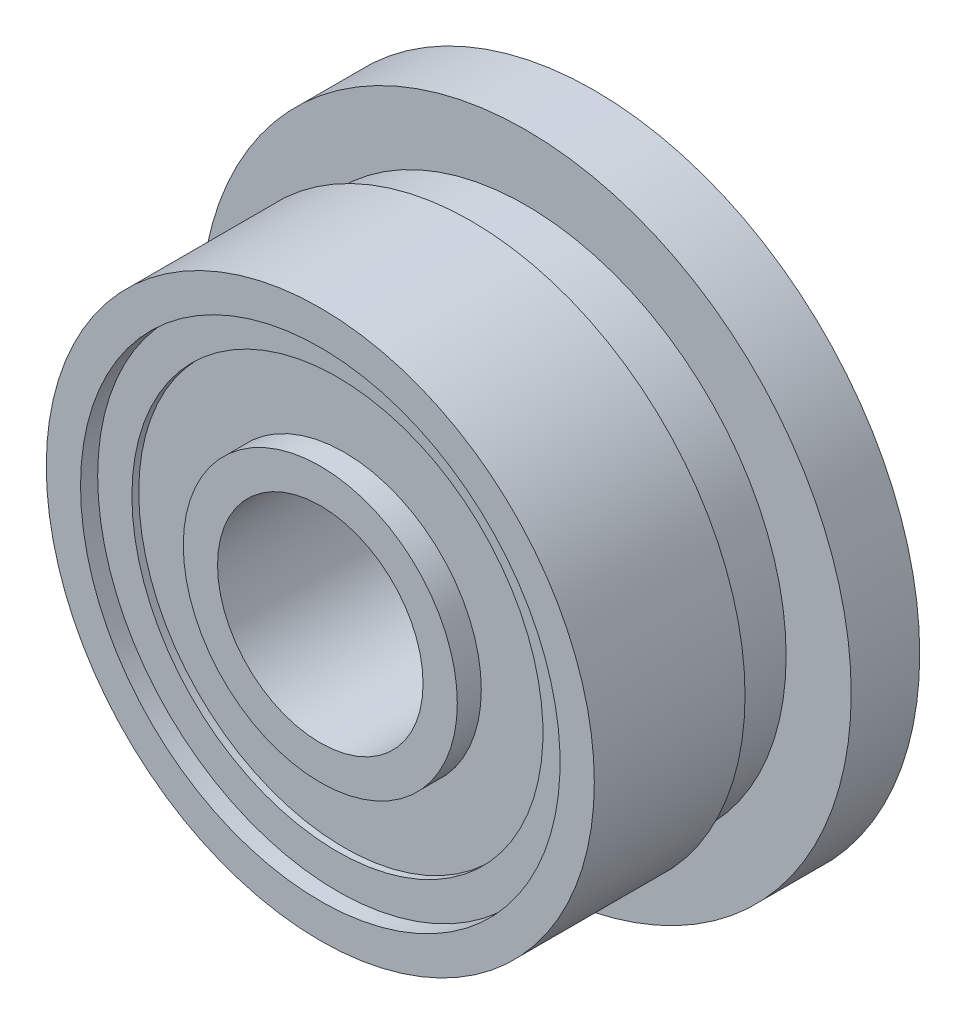
ISO-10303-21;
HEADER;
FILE_DESCRIPTION(('STEP AP214'),'2;1');
FILE_NAME('part.step','',(''),(''),'','','');
FILE_SCHEMA(('AUTOMOTIVE_DESIGN { 1 0 10303 214 1 1 1 1 }'));
ENDSEC;
DATA;
#1=APPLICATION_CONTEXT('core data for automotive mechanical design processes');
#2=APPLICATION_PROTOCOL_DEFINITION('international standard','automotive_design',2000,#1);
#3=PRODUCT_CONTEXT('',#1,'mechanical');
#4=PRODUCT('Part','Part','',(#3));
#5=PRODUCT_RELATED_PRODUCT_CATEGORY('part','',(#4));
#6=PRODUCT_DEFINITION_FORMATION('','',#4);
#7=PRODUCT_DEFINITION_CONTEXT('part definition',#1,'design');
#8=PRODUCT_DEFINITION('design','',#6,#7);
#9=PRODUCT_DEFINITION_SHAPE('','',#8);
#10=(LENGTH_UNIT() NAMED_UNIT(*) SI_UNIT(.MILLI.,.METRE.));
#11=(NAMED_UNIT(*) PLANE_ANGLE_UNIT() SI_UNIT($,.RADIAN.));
#12=(NAMED_UNIT(*) SI_UNIT($,.STERADIAN.) SOLID_ANGLE_UNIT());
#13=UNCERTAINTY_MEASURE_WITH_UNIT(LENGTH_MEASURE(1.E-05),#10,'distance_accuracy_value','');
#14=(GEOMETRIC_REPRESENTATION_CONTEXT(3) GLOBAL_UNCERTAINTY_ASSIGNED_CONTEXT((#13)) GLOBAL_UNIT_ASSIGNED_CONTEXT((#10,
#11,#12)) REPRESENTATION_CONTEXT('',''));
#15=CARTESIAN_POINT('',(0.,0.,0.));
#16=DIRECTION('',(0.,0.,1.));
#17=DIRECTION('',(1.,0.,0.));
#18=AXIS2_PLACEMENT_3D('',#15,#16,#17);
#19=CARTESIAN_POINT('',(0.,0.,3.75));
#20=DIRECTION('',(0.,0.,1.));
#21=DIRECTION('',(-1.,0.,0.));
#22=AXIS2_PLACEMENT_3D('',#19,#20,#21);
#23=PLANE('',#22);
#24=CARTESIAN_POINT('',(0.,0.,3.75));
#25=DIRECTION('',(0.,0.,-1.));
#26=DIRECTION('',(-1.,0.,0.));
#27=AXIS2_PLACEMENT_3D('',#24,#25,#26);
#28=CIRCLE('',#27,3.5);
#29=CARTESIAN_POINT('',(-3.5,0.,3.75));
#30=VERTEX_POINT('',#29);
#31=EDGE_CURVE('E85',#30,#30,#28,.T.);
#32=ORIENTED_EDGE('',*,*,#31,.F.);
#33=EDGE_LOOP('',(#32));
#34=FACE_BOUND('',#33,.T.);
#35=CARTESIAN_POINT('',(0.,0.,3.75));
#36=DIRECTION('',(0.,0.,-1.));
#37=DIRECTION('',(-1.,0.,0.));
#38=AXIS2_PLACEMENT_3D('',#35,#36,#37);
#39=CIRCLE('',#38,3.);
#40=CARTESIAN_POINT('',(-3.,0.,3.75));
#41=VERTEX_POINT('',#40);
#42=EDGE_CURVE('E98',#41,#41,#39,.T.);
#43=ORIENTED_EDGE('',*,*,#42,.T.);
#44=EDGE_LOOP('',(#43));
#45=FACE_BOUND('',#44,.T.);
#46=ADVANCED_FACE('F41',(#34,#45),#23,.T.);
#47=CARTESIAN_POINT('',(0.,0.,4.));
#48=DIRECTION('',(0.,0.,1.));
#49=DIRECTION('',(1.,0.,0.));
#50=AXIS2_PLACEMENT_3D('',#47,#48,#49);
#51=PLANE('',#50);
#52=CARTESIAN_POINT('',(0.,0.,4.));
#53=DIRECTION('',(0.,0.,1.));
#54=DIRECTION('',(1.,0.,0.));
#55=AXIS2_PLACEMENT_3D('',#52,#53,#54);
#56=CIRCLE('',#55,1.5);
#57=CARTESIAN_POINT('',(1.5,0.,4.));
#58=VERTEX_POINT('',#57);
#59=EDGE_CURVE('E54',#58,#58,#56,.T.);
#60=ORIENTED_EDGE('',*,*,#59,.F.);
#61=EDGE_LOOP('',(#60));
#62=FACE_BOUND('',#61,.T.);
#63=CARTESIAN_POINT('',(0.,0.,4.));
#64=DIRECTION('',(0.,0.,-1.));
#65=DIRECTION('',(-1.,0.,0.));
#66=AXIS2_PLACEMENT_3D('',#63,#64,#65);
#67=CIRCLE('',#66,2.);
#68=CARTESIAN_POINT('',(-2.,0.,4.));
#69=VERTEX_POINT('',#68);
#70=EDGE_CURVE('E90',#69,#69,#67,.T.);
#71=ORIENTED_EDGE('',*,*,#70,.F.);
#72=EDGE_LOOP('',(#71));
#73=FACE_BOUND('',#72,.T.);
#74=ADVANCED_FACE('F150',(#62,#73),#51,.T.);
#75=CARTESIAN_POINT('',(0.,0.,0.));
#76=DIRECTION('',(0.,0.,1.));
#77=DIRECTION('',(1.,0.,0.));
#78=AXIS2_PLACEMENT_3D('',#75,#76,#77);
#79=PLANE('',#78);
#80=CARTESIAN_POINT('',(0.,0.,0.));
#81=DIRECTION('',(0.,0.,1.));
#82=DIRECTION('',(1.,0.,0.));
#83=AXIS2_PLACEMENT_3D('',#80,#81,#82);
#84=CIRCLE('',#83,1.5);
#85=CARTESIAN_POINT('',(1.5,0.,0.));
#86=VERTEX_POINT('',#85);
#87=EDGE_CURVE('E49',#86,#86,#84,.T.);
#88=ORIENTED_EDGE('',*,*,#87,.T.);
#89=EDGE_LOOP('',(#88));
#90=FACE_BOUND('',#89,.T.);
#91=CARTESIAN_POINT('',(0.,0.,0.));
#92=DIRECTION('',(0.,0.,-1.));
#93=DIRECTION('',(-1.,0.,0.));
#94=AXIS2_PLACEMENT_3D('',#91,#92,#93);
#95=CIRCLE('',#94,2.);
#96=CARTESIAN_POINT('',(-2.,0.,0.));
#97=VERTEX_POINT('',#96);
#98=EDGE_CURVE('E66',#97,#97,#95,.T.);
#99=ORIENTED_EDGE('',*,*,#98,.T.);
#100=EDGE_LOOP('',(#99));
#101=FACE_BOUND('',#100,.T.);
#102=ADVANCED_FACE('F156',(#90,#101),#79,.F.);
#103=CARTESIAN_POINT('',(0.,0.,4.));
#104=DIRECTION('',(0.,0.,-1.));
#105=DIRECTION('',(-1.,0.,0.));
#106=AXIS2_PLACEMENT_3D('',#103,#104,#105);
#107=CYLINDRICAL_SURFACE('',#106,4.);
#108=CARTESIAN_POINT('',(0.,0.,1.8));
#109=DIRECTION('',(0.,0.,1.));
#110=DIRECTION('',(1.,0.,0.));
#111=AXIS2_PLACEMENT_3D('',#108,#109,#110);
#112=CIRCLE('',#111,4.);
#113=CARTESIAN_POINT('',(4.,0.,1.8));
#114=VERTEX_POINT('',#113);
#115=EDGE_CURVE('E114',#114,#114,#112,.T.);
#116=ORIENTED_EDGE('',*,*,#115,.T.);
#117=EDGE_LOOP('',(#116));
#118=FACE_BOUND('',#117,.T.);
#119=CARTESIAN_POINT('',(0.,0.,4.));
#120=DIRECTION('',(0.,0.,1.));
#121=DIRECTION('',(1.,0.,0.));
#122=AXIS2_PLACEMENT_3D('',#119,#120,#121);
#123=CIRCLE('',#122,4.);
#124=CARTESIAN_POINT('',(4.,0.,4.));
#125=VERTEX_POINT('',#124);
#126=EDGE_CURVE('E10',#125,#125,#123,.T.);
#127=ORIENTED_EDGE('',*,*,#126,.F.);
#128=EDGE_LOOP('',(#127));
#129=FACE_BOUND('',#128,.T.);
#130=ADVANCED_FACE('F43',(#118,#129),#107,.T.);
#131=CARTESIAN_POINT('',(0.,0.,4.));
#132=DIRECTION('',(0.,0.,-1.));
#133=DIRECTION('',(-1.,0.,0.));
#134=AXIS2_PLACEMENT_3D('',#131,#132,#133);
#135=CIRCLE('',#134,3.5);
#136=CARTESIAN_POINT('',(-3.5,0.,4.));
#137=VERTEX_POINT('',#136);
#138=EDGE_CURVE('E86',#137,#137,#135,.T.);
#139=ORIENTED_EDGE('',*,*,#138,.T.);
#140=EDGE_LOOP('',(#139));
#141=FACE_BOUND('',#140,.T.);
#142=ORIENTED_EDGE('',*,*,#126,.T.);
#143=EDGE_LOOP('',(#142));
#144=FACE_BOUND('',#143,.T.);
#145=ADVANCED_FACE('F159',(#141,#144),#51,.T.);
#146=CARTESIAN_POINT('',(0.,0.,0.));
#147=DIRECTION('',(0.,0.,-1.));
#148=DIRECTION('',(-1.,0.,0.));
#149=AXIS2_PLACEMENT_3D('',#146,#147,#148);
#150=CIRCLE('',#149,3.5);
#151=CARTESIAN_POINT('',(-3.5,0.,0.));
#152=VERTEX_POINT('',#151);
#153=EDGE_CURVE('E62',#152,#152,#150,.T.);
#154=ORIENTED_EDGE('',*,*,#153,.F.);
#155=EDGE_LOOP('',(#154));
#156=FACE_BOUND('',#155,.T.);
#157=CARTESIAN_POINT('',(0.,0.,0.));
#158=DIRECTION('',(0.,0.,1.));
#159=DIRECTION('',(1.,0.,0.));
#160=AXIS2_PLACEMENT_3D('',#157,#158,#159);
#161=CIRCLE('',#160,4.75);
#162=CARTESIAN_POINT('',(4.75,0.,0.));
#163=VERTEX_POINT('',#162);
#164=EDGE_CURVE('E110',#163,#163,#161,.T.);
#165=ORIENTED_EDGE('',*,*,#164,.F.);
#166=EDGE_LOOP('',(#165));
#167=FACE_BOUND('',#166,.T.);
#168=ADVANCED_FACE('F191',(#156,#167),#79,.F.);
#169=CARTESIAN_POINT('',(0.,0.,0.));
#170=DIRECTION('',(0.,0.,1.));
#171=DIRECTION('',(1.,0.,0.));
#172=AXIS2_PLACEMENT_3D('',#169,#170,#171);
#173=CYLINDRICAL_SURFACE('',#172,1.5);
#174=ORIENTED_EDGE('',*,*,#87,.F.);
#175=EDGE_LOOP('',(#174));
#176=FACE_BOUND('',#175,.T.);
#177=ORIENTED_EDGE('',*,*,#59,.T.);
#178=EDGE_LOOP('',(#177));
#179=FACE_BOUND('',#178,.T.);
#180=ADVANCED_FACE('F188',(#176,#179),#173,.F.);
#181=CARTESIAN_POINT('',(0.,0.,0.25));
#182=DIRECTION('',(0.,0.,-1.));
#183=DIRECTION('',(-1.,0.,0.));
#184=AXIS2_PLACEMENT_3D('',#181,#182,#183);
#185=CYLINDRICAL_SURFACE('',#184,3.5);
#186=CARTESIAN_POINT('',(0.,0.,0.25));
#187=DIRECTION('',(0.,0.,-1.));
#188=DIRECTION('',(-1.,0.,0.));
#189=AXIS2_PLACEMENT_3D('',#186,#187,#188);
#190=CIRCLE('',#189,3.5);
#191=CARTESIAN_POINT('',(-3.5,0.,0.25));
#192=VERTEX_POINT('',#191);
#193=EDGE_CURVE('E60',#192,#192,#190,.T.);
#194=ORIENTED_EDGE('',*,*,#193,.F.);
#195=EDGE_LOOP('',(#194));
#196=FACE_BOUND('',#195,.T.);
#197=ORIENTED_EDGE('',*,*,#153,.T.);
#198=EDGE_LOOP('',(#197));
#199=FACE_BOUND('',#198,.T.);
#200=ADVANCED_FACE('F184',(#196,#199),#185,.F.);
#201=CARTESIAN_POINT('',(0.,0.,0.25));
#202=DIRECTION('',(0.,0.,-1.));
#203=DIRECTION('',(-1.,0.,0.));
#204=AXIS2_PLACEMENT_3D('',#201,#202,#203);
#205=PLANE('',#204);
#206=CARTESIAN_POINT('',(0.,0.,0.25));
#207=DIRECTION('',(0.,0.,-1.));
#208=DIRECTION('',(-1.,0.,0.));
#209=AXIS2_PLACEMENT_3D('',#206,#207,#208);
#210=CIRCLE('',#209,3.);
#211=CARTESIAN_POINT('',(-3.,0.,0.25));
#212=VERTEX_POINT('',#211);
#213=EDGE_CURVE('E74',#212,#212,#210,.T.);
#214=ORIENTED_EDGE('',*,*,#213,.F.);
#215=EDGE_LOOP('',(#214));
#216=FACE_BOUND('',#215,.T.);
#217=ORIENTED_EDGE('',*,*,#193,.T.);
#218=EDGE_LOOP('',(#217));
#219=FACE_BOUND('',#218,.T.);
#220=ADVANCED_FACE('F180',(#216,#219),#205,.T.);
#221=CARTESIAN_POINT('',(0.,0.,0.25));
#222=DIRECTION('',(0.,0.,-1.));
#223=DIRECTION('',(-1.,0.,0.));
#224=AXIS2_PLACEMENT_3D('',#221,#222,#223);
#225=CYLINDRICAL_SURFACE('',#224,2.);
#226=ORIENTED_EDGE('',*,*,#98,.F.);
#227=EDGE_LOOP('',(#226));
#228=FACE_BOUND('',#227,.T.);
#229=CARTESIAN_POINT('',(0.,0.,0.35));
#230=DIRECTION('',(0.,0.,-1.));
#231=DIRECTION('',(-1.,0.,0.));
#232=AXIS2_PLACEMENT_3D('',#229,#230,#231);
#233=CIRCLE('',#232,2.);
#234=CARTESIAN_POINT('',(-2.,0.,0.35));
#235=VERTEX_POINT('',#234);
#236=EDGE_CURVE('E78',#235,#235,#233,.T.);
#237=ORIENTED_EDGE('',*,*,#236,.T.);
#238=EDGE_LOOP('',(#237));
#239=FACE_BOUND('',#238,.T.);
#240=ADVANCED_FACE('F176',(#228,#239),#225,.T.);
#241=CARTESIAN_POINT('',(0.,0.,0.35));
#242=DIRECTION('',(0.,0.,-1.));
#243=DIRECTION('',(-1.,0.,0.));
#244=AXIS2_PLACEMENT_3D('',#241,#242,#243);
#245=CYLINDRICAL_SURFACE('',#244,3.);
#246=CARTESIAN_POINT('',(0.,0.,0.35));
#247=DIRECTION('',(0.,0.,-1.));
#248=DIRECTION('',(-1.,0.,0.));
#249=AXIS2_PLACEMENT_3D('',#246,#247,#248);
#250=CIRCLE('',#249,3.);
#251=CARTESIAN_POINT('',(-3.,0.,0.35));
#252=VERTEX_POINT('',#251);
#253=EDGE_CURVE('E73',#252,#252,#250,.T.);
#254=ORIENTED_EDGE('',*,*,#253,.F.);
#255=EDGE_LOOP('',(#254));
#256=FACE_BOUND('',#255,.T.);
#257=ORIENTED_EDGE('',*,*,#213,.T.);
#258=EDGE_LOOP('',(#257));
#259=FACE_BOUND('',#258,.T.);
#260=ADVANCED_FACE('F172',(#256,#259),#245,.F.);
#261=CARTESIAN_POINT('',(0.,0.,0.35));
#262=DIRECTION('',(0.,0.,-1.));
#263=DIRECTION('',(-1.,0.,0.));
#264=AXIS2_PLACEMENT_3D('',#261,#262,#263);
#265=PLANE('',#264);
#266=ORIENTED_EDGE('',*,*,#236,.F.);
#267=EDGE_LOOP('',(#266));
#268=FACE_BOUND('',#267,.T.);
#269=ORIENTED_EDGE('',*,*,#253,.T.);
#270=EDGE_LOOP('',(#269));
#271=FACE_BOUND('',#270,.T.);
#272=ADVANCED_FACE('F168',(#268,#271),#265,.T.);
#273=CARTESIAN_POINT('',(0.,0.,3.75));
#274=DIRECTION('',(0.,0.,1.));
#275=DIRECTION('',(1.,0.,0.));
#276=AXIS2_PLACEMENT_3D('',#273,#274,#275);
#277=CYLINDRICAL_SURFACE('',#276,3.5);
#278=ORIENTED_EDGE('',*,*,#31,.T.);
#279=EDGE_LOOP('',(#278));
#280=FACE_BOUND('',#279,.T.);
#281=ORIENTED_EDGE('',*,*,#138,.F.);
#282=EDGE_LOOP('',(#281));
#283=FACE_BOUND('',#282,.T.);
#284=ADVANCED_FACE('F165',(#280,#283),#277,.F.);
#285=CARTESIAN_POINT('',(0.,0.,3.75));
#286=DIRECTION('',(0.,0.,1.));
#287=DIRECTION('',(1.,0.,0.));
#288=AXIS2_PLACEMENT_3D('',#285,#286,#287);
#289=CYLINDRICAL_SURFACE('',#288,2.);
#290=ORIENTED_EDGE('',*,*,#70,.T.);
#291=EDGE_LOOP('',(#290));
#292=FACE_BOUND('',#291,.T.);
#293=CARTESIAN_POINT('',(0.,0.,3.65));
#294=DIRECTION('',(0.,0.,-1.));
#295=DIRECTION('',(-1.,0.,0.));
#296=AXIS2_PLACEMENT_3D('',#293,#294,#295);
#297=CIRCLE('',#296,2.);
#298=CARTESIAN_POINT('',(-2.,0.,3.65));
#299=VERTEX_POINT('',#298);
#300=EDGE_CURVE('E102',#299,#299,#297,.T.);
#301=ORIENTED_EDGE('',*,*,#300,.F.);
#302=EDGE_LOOP('',(#301));
#303=FACE_BOUND('',#302,.T.);
#304=ADVANCED_FACE('F164',(#292,#303),#289,.T.);
#305=CARTESIAN_POINT('',(0.,0.,3.65));
#306=DIRECTION('',(0.,0.,1.));
#307=DIRECTION('',(-1.,0.,0.));
#308=AXIS2_PLACEMENT_3D('',#305,#306,#307);
#309=PLANE('',#308);
#310=CARTESIAN_POINT('',(0.,0.,3.65));
#311=DIRECTION('',(0.,0.,-1.));
#312=DIRECTION('',(-1.,0.,0.));
#313=AXIS2_PLACEMENT_3D('',#310,#311,#312);
#314=CIRCLE('',#313,3.);
#315=CARTESIAN_POINT('',(-3.,0.,3.65));
#316=VERTEX_POINT('',#315);
#317=EDGE_CURVE('E97',#316,#316,#314,.T.);
#318=ORIENTED_EDGE('',*,*,#317,.F.);
#319=EDGE_LOOP('',(#318));
#320=FACE_BOUND('',#319,.T.);
#321=ORIENTED_EDGE('',*,*,#300,.T.);
#322=EDGE_LOOP('',(#321));
#323=FACE_BOUND('',#322,.T.);
#324=ADVANCED_FACE('F145',(#320,#323),#309,.T.);
#325=CARTESIAN_POINT('',(0.,0.,3.65));
#326=DIRECTION('',(0.,0.,1.));
#327=DIRECTION('',(1.,0.,0.));
#328=AXIS2_PLACEMENT_3D('',#325,#326,#327);
#329=CYLINDRICAL_SURFACE('',#328,3.);
#330=ORIENTED_EDGE('',*,*,#317,.T.);
#331=EDGE_LOOP('',(#330));
#332=FACE_BOUND('',#331,.T.);
#333=ORIENTED_EDGE('',*,*,#42,.F.);
#334=EDGE_LOOP('',(#333));
#335=FACE_BOUND('',#334,.T.);
#336=ADVANCED_FACE('F135',(#332,#335),#329,.F.);
#337=CARTESIAN_POINT('',(0.,0.,1.));
#338=DIRECTION('',(0.,0.,1.));
#339=DIRECTION('',(1.,0.,0.));
#340=AXIS2_PLACEMENT_3D('',#337,#338,#339);
#341=PLANE('',#340);
#342=CARTESIAN_POINT('',(0.,0.,1.));
#343=DIRECTION('',(0.,0.,1.));
#344=DIRECTION('',(1.,0.,0.));
#345=AXIS2_PLACEMENT_3D('',#342,#343,#344);
#346=CIRCLE('',#345,4.75);
#347=CARTESIAN_POINT('',(4.75,0.,1.));
#348=VERTEX_POINT('',#347);
#349=EDGE_CURVE('E109',#348,#348,#346,.T.);
#350=ORIENTED_EDGE('',*,*,#349,.T.);
#351=EDGE_LOOP('',(#350));
#352=FACE_BOUND('',#351,.T.);
#353=CARTESIAN_POINT('',(0.,0.,1.));
#354=DIRECTION('',(0.,0.,1.));
#355=DIRECTION('',(1.,0.,0.));
#356=AXIS2_PLACEMENT_3D('',#353,#354,#355);
#357=CIRCLE('',#356,3.8);
#358=CARTESIAN_POINT('',(3.8,0.,1.));
#359=VERTEX_POINT('',#358);
#360=EDGE_CURVE('E125',#359,#359,#357,.T.);
#361=ORIENTED_EDGE('',*,*,#360,.F.);
#362=EDGE_LOOP('',(#361));
#363=FACE_BOUND('',#362,.T.);
#364=ADVANCED_FACE('F132',(#352,#363),#341,.T.);
#365=CARTESIAN_POINT('',(0.,0.,1.));
#366=DIRECTION('',(0.,0.,-1.));
#367=DIRECTION('',(-1.,0.,0.));
#368=AXIS2_PLACEMENT_3D('',#365,#366,#367);
#369=CYLINDRICAL_SURFACE('',#368,4.75);
#370=ORIENTED_EDGE('',*,*,#349,.F.);
#371=EDGE_LOOP('',(#370));
#372=FACE_BOUND('',#371,.T.);
#373=ORIENTED_EDGE('',*,*,#164,.T.);
#374=EDGE_LOOP('',(#373));
#375=FACE_BOUND('',#374,.T.);
#376=ADVANCED_FACE('F134',(#372,#375),#369,.T.);
#377=CARTESIAN_POINT('',(4.,0.,1.8));
#378=DIRECTION('',(0.,0.,1.));
#379=DIRECTION('',(1.,0.,0.));
#380=AXIS2_PLACEMENT_3D('',#377,#378,#379);
#381=PLANE('',#380);
#382=ORIENTED_EDGE('',*,*,#115,.F.);
#383=EDGE_LOOP('',(#382));
#384=FACE_BOUND('',#383,.T.);
#385=CARTESIAN_POINT('',(0.,0.,1.8));
#386=DIRECTION('',(0.,0.,1.));
#387=DIRECTION('',(1.,0.,0.));
#388=AXIS2_PLACEMENT_3D('',#385,#386,#387);
#389=CIRCLE('',#388,3.8);
#390=CARTESIAN_POINT('',(3.8,0.,1.8));
#391=VERTEX_POINT('',#390);
#392=EDGE_CURVE('E121',#391,#391,#389,.T.);
#393=ORIENTED_EDGE('',*,*,#392,.T.);
#394=EDGE_LOOP('',(#393));
#395=FACE_BOUND('',#394,.T.);
#396=ADVANCED_FACE('F142',(#384,#395),#381,.F.);
#397=CARTESIAN_POINT('',(0.,0.,4.));
#398=DIRECTION('',(0.,0.,1.));
#399=DIRECTION('',(1.,0.,0.));
#400=AXIS2_PLACEMENT_3D('',#397,#398,#399);
#401=CYLINDRICAL_SURFACE('',#400,3.8);
#402=ORIENTED_EDGE('',*,*,#392,.F.);
#403=EDGE_LOOP('',(#402));
#404=FACE_BOUND('',#403,.T.);
#405=ORIENTED_EDGE('',*,*,#360,.T.);
#406=EDGE_LOOP('',(#405));
#407=FACE_BOUND('',#406,.T.);
#408=ADVANCED_FACE('F130',(#404,#407),#401,.T.);
#409=CLOSED_SHELL('',(#46,#74,#102,#130,#145,#168,#180,#200,#220,#240,#260,#272,#284,#304,#324,
#336,#364,#376,#396,#408));
#410=MANIFOLD_SOLID_BREP('B2',#409);
#411=ADVANCED_BREP_SHAPE_REPRESENTATION('',(#18,#410),#14);
#412=SHAPE_DEFINITION_REPRESENTATION(#9,#411);
ENDSEC;
END-ISO-10303-21;
